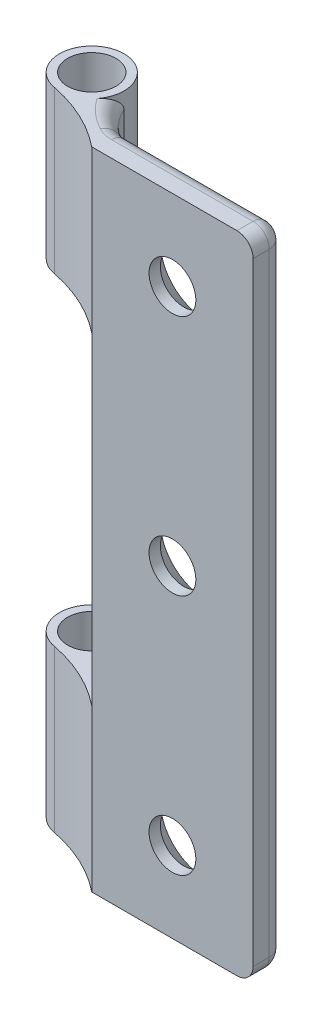
ISO-10303-21;
HEADER;
FILE_DESCRIPTION(('STEP AP214'),'2;1');
FILE_NAME('part.step','',(''),(''),'','','');
FILE_SCHEMA(('AUTOMOTIVE_DESIGN { 1 0 10303 214 1 1 1 1 }'));
ENDSEC;
DATA;
#1=APPLICATION_CONTEXT('core data for automotive mechanical design processes');
#2=APPLICATION_PROTOCOL_DEFINITION('international standard','automotive_design',2000,#1);
#3=PRODUCT_CONTEXT('',#1,'mechanical');
#4=PRODUCT('Part','Part','',(#3));
#5=PRODUCT_RELATED_PRODUCT_CATEGORY('part','',(#4));
#6=PRODUCT_DEFINITION_FORMATION('','',#4);
#7=PRODUCT_DEFINITION_CONTEXT('part definition',#1,'design');
#8=PRODUCT_DEFINITION('design','',#6,#7);
#9=PRODUCT_DEFINITION_SHAPE('','',#8);
#10=(LENGTH_UNIT() NAMED_UNIT(*) SI_UNIT(.MILLI.,.METRE.));
#11=(NAMED_UNIT(*) PLANE_ANGLE_UNIT() SI_UNIT($,.RADIAN.));
#12=(NAMED_UNIT(*) SI_UNIT($,.STERADIAN.) SOLID_ANGLE_UNIT());
#13=UNCERTAINTY_MEASURE_WITH_UNIT(LENGTH_MEASURE(1.E-05),#10,'distance_accuracy_value','');
#14=(GEOMETRIC_REPRESENTATION_CONTEXT(3) GLOBAL_UNCERTAINTY_ASSIGNED_CONTEXT((#13)) GLOBAL_UNIT_ASSIGNED_CONTEXT((#10,
#11,#12)) REPRESENTATION_CONTEXT('',''));
#15=CARTESIAN_POINT('',(0.,0.,0.));
#16=DIRECTION('',(0.,0.,1.));
#17=DIRECTION('',(1.,0.,0.));
#18=AXIS2_PLACEMENT_3D('',#15,#16,#17);
#19=CARTESIAN_POINT('',(-3.35424868893541,40.,-4.64575131106459));
#20=DIRECTION('',(0.,-1.,0.));
#21=DIRECTION('',(0.,0.,-1.));
#22=AXIS2_PLACEMENT_3D('',#19,#20,#21);
#23=CYLINDRICAL_SURFACE('',#22,4.);
#24=DIRECTION('',(0.,-1.,0.));
#25=VECTOR('',#24,1.);
#26=CARTESIAN_POINT('',(-5.23986677209954,40.,-1.1180828963118));
#27=LINE('',#26,#25);
#28=CARTESIAN_POINT('',(-5.23986677209954,10.,-1.1180828963118));
#29=VERTEX_POINT('',#28);
#30=CARTESIAN_POINT('',(-5.23986677209954,1.,-1.1180828963118));
#31=VERTEX_POINT('',#30);
#32=EDGE_CURVE('E490',#29,#31,#27,.T.);
#33=ORIENTED_EDGE('',*,*,#32,.T.);
#34=CARTESIAN_POINT('',(-3.35424868893541,1.,-4.64575131106459));
#35=DIRECTION('',(0.,-1.,0.));
#36=DIRECTION('',(0.,0.,-1.));
#37=AXIS2_PLACEMENT_3D('',#34,#35,#36);
#38=CIRCLE('',#37,4.);
#39=CARTESIAN_POINT('',(-7.,1.,-3.));
#40=VERTEX_POINT('',#39);
#41=EDGE_CURVE('E487',#31,#40,#38,.T.);
#42=ORIENTED_EDGE('',*,*,#41,.T.);
#43=DIRECTION('',(0.,-1.,0.));
#44=VECTOR('',#43,1.);
#45=CARTESIAN_POINT('',(-7.,40.,-3.));
#46=LINE('',#45,#44);
#47=CARTESIAN_POINT('',(-7.,10.,-3.));
#48=VERTEX_POINT('',#47);
#49=EDGE_CURVE('E337',#48,#40,#46,.T.);
#50=ORIENTED_EDGE('',*,*,#49,.F.);
#51=CARTESIAN_POINT('',(-3.35424868893541,10.,-4.64575131106459));
#52=DIRECTION('',(0.,-1.,0.));
#53=DIRECTION('',(0.,0.,-1.));
#54=AXIS2_PLACEMENT_3D('',#51,#52,#53);
#55=CIRCLE('',#54,4.);
#56=EDGE_CURVE('E238',#48,#29,#55,.F.);
#57=ORIENTED_EDGE('',*,*,#56,.T.);
#58=EDGE_LOOP('',(#33,#42,#50,#57));
#59=FACE_BOUND('',#58,.T.);
#60=ADVANCED_FACE('F34',(#59),#23,.F.);
#61=CARTESIAN_POINT('',(-9.,40.,-3.));
#62=DIRECTION('',(0.,-1.,0.));
#63=DIRECTION('',(0.,0.,-1.));
#64=AXIS2_PLACEMENT_3D('',#61,#62,#63);
#65=CYLINDRICAL_SURFACE('',#64,2.);
#66=CARTESIAN_POINT('',(-9.,30.,-3.));
#67=DIRECTION('',(0.,1.,0.));
#68=DIRECTION('',(0.,0.,1.));
#69=AXIS2_PLACEMENT_3D('',#66,#67,#68);
#70=CIRCLE('',#69,2.);
#71=CARTESIAN_POINT('',(-7.,30.,-3.));
#72=VERTEX_POINT('',#71);
#73=CARTESIAN_POINT('',(-9.33223157316066,30.,-1.02778749071121));
#74=VERTEX_POINT('',#73);
#75=EDGE_CURVE('E204',#72,#74,#70,.T.);
#76=ORIENTED_EDGE('',*,*,#75,.T.);
#77=DIRECTION('',(0.,-1.,0.));
#78=VECTOR('',#77,1.);
#79=CARTESIAN_POINT('',(-9.33223157316066,40.,-1.02778749071121));
#80=LINE('',#79,#78);
#81=CARTESIAN_POINT('',(-9.33223157316066,40.,-1.02778749071121));
#82=VERTEX_POINT('',#81);
#83=EDGE_CURVE('E203',#82,#74,#80,.T.);
#84=ORIENTED_EDGE('',*,*,#83,.F.);
#85=CARTESIAN_POINT('',(-9.,40.,-3.));
#86=DIRECTION('',(0.,1.,0.));
#87=DIRECTION('',(0.,0.,1.));
#88=AXIS2_PLACEMENT_3D('',#85,#86,#87);
#89=CIRCLE('',#88,2.);
#90=CARTESIAN_POINT('',(-7.43430554528277,40.,-1.75557206939585));
#91=VERTEX_POINT('',#90);
#92=EDGE_CURVE('E226',#91,#82,#89,.T.);
#93=ORIENTED_EDGE('',*,*,#92,.F.);
#94=CARTESIAN_POINT('',(-7.43430554528277,40.,-1.75557206939585));
#95=CARTESIAN_POINT('',(-7.4150057668606,40.0000030900498,-1.7798469271056));
#96=CARTESIAN_POINT('',(-7.39629370004343,39.9986695147384,-1.80455712382706));
#97=CARTESIAN_POINT('',(-7.36017475547062,39.9934906334173,-1.85460902211591));
#98=CARTESIAN_POINT('',(-7.34276610637677,39.9896488078002,-1.8799498019033));
#99=CARTESIAN_POINT('',(-7.29296343271528,39.9747024314774,-1.9561249645298));
#100=CARTESIAN_POINT('',(-7.2625829808326,39.9601698237683,-2.00763108891593));
#101=CARTESIAN_POINT('',(-7.20146143480147,39.9193193959632,-2.12229162157638));
#102=CARTESIAN_POINT('',(-7.17212813587114,39.8911053209478,-2.18550155241853));
#103=CARTESIAN_POINT('',(-7.12135311287869,39.825512162979,-2.31059719990692));
#104=CARTESIAN_POINT('',(-7.09994974370381,39.788089956275,-2.37247515130802));
#105=CARTESIAN_POINT('',(-7.06390198258814,39.7051205101415,-2.49440200308605));
#106=CARTESIAN_POINT('',(-7.04938957941584,39.6594361025798,-2.55439609412861));
#107=CARTESIAN_POINT('',(-7.03230361613203,39.5858178275685,-2.64078682289565));
#108=CARTESIAN_POINT('',(-7.02739065394011,39.5604505557457,-2.66896403410609));
#109=CARTESIAN_POINT('',(-7.01896556574205,39.507941447991,-2.72382853555625));
#110=CARTESIAN_POINT('',(-7.0154527921834,39.480800439144,-2.75051650960849));
#111=CARTESIAN_POINT('',(-7.00955402441986,39.4234976173311,-2.80290748637494));
#112=CARTESIAN_POINT('',(-7.00721646148099,39.3932598378395,-2.82853334979578));
#113=CARTESIAN_POINT('',(-7.00365730452691,39.3302872959212,-2.8767262790706));
#114=CARTESIAN_POINT('',(-7.00243619214559,39.2975514624321,-2.89929202122438));
#115=CARTESIAN_POINT('',(-7.00099625179923,39.2368576344072,-2.93497453224518));
#116=CARTESIAN_POINT('',(-7.00061327793467,39.209491844955,-2.94907420263327));
#117=CARTESIAN_POINT('',(-7.00014833159175,39.152978399649,-2.97287273009642));
#118=CARTESIAN_POINT('',(-7.0000647017332,39.1238414663835,-2.9825955576289));
#119=CARTESIAN_POINT('',(-7.00000983475217,39.0786607493764,-2.99279153053478));
#120=CARTESIAN_POINT('',(-7.00000378322867,39.0631088051266,-2.99546385421141));
#121=CARTESIAN_POINT('',(-6.99999993860628,39.0317118591225,-2.99908195841621));
#122=CARTESIAN_POINT('',(-7.00000219591448,39.0158656508253,-3.00001714865302));
#123=CARTESIAN_POINT('',(-7.,39.,-3.));
#124=B_SPLINE_CURVE_WITH_KNOTS('',3,(#94,#95,#96,#97,#98,#99,#100,#101,#102,#103,#104,#105,#106,
#107,#108,#109,#110,#111,#112,#113,#114,#115,#116,#117,#118,#119,#120,#121,#122,#123),
.UNSPECIFIED.,.F.,.F.,(4,2,2,2,2,2,2,2,2,2,2,2,2,2,4),(0.,0.0929568239538435,0.185784936429213,
0.369487359128304,0.593839793985812,0.819263616038914,1.04884650396993,1.16346750141809,
1.27803542782291,1.39700137972105,1.51601862904216,1.60813820269042,1.69974694138695,
1.74699631210699,1.79453280113445),.UNSPECIFIED.);
#125=CARTESIAN_POINT('',(-7.,39.,-3.));
#126=VERTEX_POINT('',#125);
#127=EDGE_CURVE('E343',#91,#126,#124,.T.);
#128=ORIENTED_EDGE('',*,*,#127,.T.);
#129=EDGE_CURVE('E331',#126,#72,#46,.T.);
#130=ORIENTED_EDGE('',*,*,#129,.T.);
#131=EDGE_LOOP('',(#76,#84,#93,#128,#130));
#132=FACE_BOUND('',#131,.T.);
#133=ADVANCED_FACE('F314',(#132),#65,.T.);
#134=CARTESIAN_POINT('',(-11.2823746721404,40.,8.78021648020466));
#135=DIRECTION('',(0.,-1.,0.));
#136=DIRECTION('',(0.,0.,-1.));
#137=AXIS2_PLACEMENT_3D('',#134,#135,#136);
#138=CYLINDRICAL_SURFACE('',#137,10.);
#139=DIRECTION('',(0.,-1.,0.));
#140=VECTOR('',#139,1.);
#141=CARTESIAN_POINT('',(-5.,40.,1.));
#142=LINE('',#141,#140);
#143=CARTESIAN_POINT('',(-5.,10.,1.));
#144=VERTEX_POINT('',#143);
#145=CARTESIAN_POINT('',(-5.,0.,1.));
#146=VERTEX_POINT('',#145);
#147=EDGE_CURVE('E184',#144,#146,#142,.T.);
#148=ORIENTED_EDGE('',*,*,#147,.F.);
#149=CARTESIAN_POINT('',(-11.2823746721404,10.,8.78021648020466));
#150=DIRECTION('',(0.,-1.,0.));
#151=DIRECTION('',(0.,0.,-1.));
#152=AXIS2_PLACEMENT_3D('',#149,#150,#151);
#153=CIRCLE('',#152,10.);
#154=CARTESIAN_POINT('',(-9.33223157316066,10.,-1.02778749071121));
#155=VERTEX_POINT('',#154);
#156=EDGE_CURVE('E246',#144,#155,#153,.F.);
#157=ORIENTED_EDGE('',*,*,#156,.T.);
#158=CARTESIAN_POINT('',(-9.33223157316066,0.,-1.02778749071121));
#159=VERTEX_POINT('',#158);
#160=EDGE_CURVE('E211',#155,#159,#80,.T.);
#161=ORIENTED_EDGE('',*,*,#160,.T.);
#162=CARTESIAN_POINT('',(-11.2823746721404,0.,8.78021648020466));
#163=DIRECTION('',(0.,-1.,0.));
#164=DIRECTION('',(0.,0.,-1.));
#165=AXIS2_PLACEMENT_3D('',#162,#163,#164);
#166=CIRCLE('',#165,10.);
#167=EDGE_CURVE('E227',#159,#146,#166,.T.);
#168=ORIENTED_EDGE('',*,*,#167,.T.);
#169=EDGE_LOOP('',(#148,#157,#161,#168));
#170=FACE_BOUND('',#169,.T.);
#171=ADVANCED_FACE('F320',(#170),#138,.F.);
#172=CARTESIAN_POINT('',(-9.,40.,-3.));
#173=DIRECTION('',(0.,-1.,0.));
#174=DIRECTION('',(0.,0.,-1.));
#175=AXIS2_PLACEMENT_3D('',#172,#173,#174);
#176=CYLINDRICAL_SURFACE('',#175,1.5);
#177=CARTESIAN_POINT('',(-9.,10.,-3.));
#178=DIRECTION('',(0.,-1.,0.));
#179=DIRECTION('',(0.,0.,-1.));
#180=AXIS2_PLACEMENT_3D('',#177,#178,#179);
#181=CIRCLE('',#180,1.5);
#182=CARTESIAN_POINT('',(-9.,10.,-4.5));
#183=VERTEX_POINT('',#182);
#184=EDGE_CURVE('E249',#183,#183,#181,.T.);
#185=ORIENTED_EDGE('',*,*,#184,.F.);
#186=EDGE_LOOP('',(#185));
#187=FACE_BOUND('',#186,.T.);
#188=CARTESIAN_POINT('',(-9.,0.,-3.));
#189=DIRECTION('',(0.,1.,0.));
#190=DIRECTION('',(0.,0.,1.));
#191=AXIS2_PLACEMENT_3D('',#188,#189,#190);
#192=CIRCLE('',#191,1.5);
#193=CARTESIAN_POINT('',(-9.,0.,-1.5));
#194=VERTEX_POINT('',#193);
#195=EDGE_CURVE('E235',#194,#194,#192,.T.);
#196=ORIENTED_EDGE('',*,*,#195,.F.);
#197=EDGE_LOOP('',(#196));
#198=FACE_BOUND('',#197,.T.);
#199=ADVANCED_FACE('F570',(#187,#198),#176,.F.);
#200=CARTESIAN_POINT('',(-11.2823746721404,40.,8.78021648020466));
#201=DIRECTION('',(0.,-1.,0.));
#202=DIRECTION('',(0.,0.,-1.));
#203=AXIS2_PLACEMENT_3D('',#200,#201,#202);
#204=PLANE('',#203);
#205=CARTESIAN_POINT('',(-3.35424868893541,40.,-4.64575131106459));
#206=DIRECTION('',(0.,-1.,0.));
#207=DIRECTION('',(0.,0.,-1.));
#208=AXIS2_PLACEMENT_3D('',#205,#206,#207);
#209=CIRCLE('',#208,5.);
#210=CARTESIAN_POINT('',(-5.71127129289057,40.,-0.236165792623606));
#211=VERTEX_POINT('',#210);
#212=EDGE_CURVE('E351',#211,#91,#209,.T.);
#213=ORIENTED_EDGE('',*,*,#212,.T.);
#214=ORIENTED_EDGE('',*,*,#92,.T.);
#215=CARTESIAN_POINT('',(-11.2823746721404,40.,8.78021648020466));
#216=DIRECTION('',(0.,-1.,0.));
#217=DIRECTION('',(0.,0.,-1.));
#218=AXIS2_PLACEMENT_3D('',#215,#216,#217);
#219=CIRCLE('',#218,10.);
#220=CARTESIAN_POINT('',(-5.,40.,1.));
#221=VERTEX_POINT('',#220);
#222=EDGE_CURVE('E221',#82,#221,#219,.T.);
#223=ORIENTED_EDGE('',*,*,#222,.T.);
#224=DIRECTION('',(1.,0.,0.));
#225=VECTOR('',#224,1.);
#226=CARTESIAN_POINT('',(-5.,40.,1.));
#227=LINE('',#226,#225);
#228=CARTESIAN_POINT('',(4.,40.,1.));
#229=VERTEX_POINT('',#228);
#230=EDGE_CURVE('E210',#221,#229,#227,.T.);
#231=ORIENTED_EDGE('',*,*,#230,.T.);
#232=DIRECTION('',(0.,0.,-1.));
#233=VECTOR('',#232,1.);
#234=CARTESIAN_POINT('',(4.,40.,8.78021648020466));
#235=LINE('',#234,#233);
#236=CARTESIAN_POINT('',(4.,40.,0.));
#237=VERTEX_POINT('',#236);
#238=EDGE_CURVE('E472',#229,#237,#235,.T.);
#239=ORIENTED_EDGE('',*,*,#238,.T.);
#240=DIRECTION('',(-1.,0.,0.));
#241=VECTOR('',#240,1.);
#242=CARTESIAN_POINT('',(-11.2823746721404,40.,0.));
#243=LINE('',#242,#241);
#244=CARTESIAN_POINT('',(-4.7684622513085,40.,0.));
#245=VERTEX_POINT('',#244);
#246=EDGE_CURVE('E473',#237,#245,#243,.T.);
#247=ORIENTED_EDGE('',*,*,#246,.T.);
#248=CARTESIAN_POINT('',(-4.7684622513085,40.,-2.));
#249=DIRECTION('',(0.,-1.,0.));
#250=DIRECTION('',(0.,0.,-1.));
#251=AXIS2_PLACEMENT_3D('',#248,#249,#250);
#252=CIRCLE('',#251,2.);
#253=EDGE_CURVE('E471',#211,#245,#252,.F.);
#254=ORIENTED_EDGE('',*,*,#253,.F.);
#255=EDGE_LOOP('',(#213,#214,#223,#231,#239,#247,#254));
#256=FACE_BOUND('',#255,.T.);
#257=CARTESIAN_POINT('',(-9.,40.,-3.));
#258=DIRECTION('',(0.,1.,0.));
#259=DIRECTION('',(0.,0.,1.));
#260=AXIS2_PLACEMENT_3D('',#257,#258,#259);
#261=CIRCLE('',#260,1.5);
#262=CARTESIAN_POINT('',(-9.,40.,-1.5));
#263=VERTEX_POINT('',#262);
#264=EDGE_CURVE('E231',#263,#263,#261,.T.);
#265=ORIENTED_EDGE('',*,*,#264,.F.);
#266=EDGE_LOOP('',(#265));
#267=FACE_BOUND('',#266,.T.);
#268=ADVANCED_FACE('F468',(#256,#267),#204,.F.);
#269=CARTESIAN_POINT('',(-11.2823746721404,0.,8.78021648020466));
#270=DIRECTION('',(0.,-1.,0.));
#271=DIRECTION('',(0.,0.,-1.));
#272=AXIS2_PLACEMENT_3D('',#269,#270,#271);
#273=PLANE('',#272);
#274=CARTESIAN_POINT('',(-9.,0.,-3.));
#275=DIRECTION('',(0.,1.,0.));
#276=DIRECTION('',(0.,0.,1.));
#277=AXIS2_PLACEMENT_3D('',#274,#275,#276);
#278=CIRCLE('',#277,2.);
#279=CARTESIAN_POINT('',(-7.43430554528277,0.,-1.75557206939585));
#280=VERTEX_POINT('',#279);
#281=EDGE_CURVE('E229',#280,#159,#278,.T.);
#282=ORIENTED_EDGE('',*,*,#281,.F.);
#283=CARTESIAN_POINT('',(-3.35424868893541,0.,-4.64575131106459));
#284=DIRECTION('',(0.,-1.,0.));
#285=DIRECTION('',(0.,0.,-1.));
#286=AXIS2_PLACEMENT_3D('',#283,#284,#285);
#287=CIRCLE('',#286,5.);
#288=CARTESIAN_POINT('',(-5.71127129289057,0.,-0.236165792623606));
#289=VERTEX_POINT('',#288);
#290=EDGE_CURVE('E478',#280,#289,#287,.F.);
#291=ORIENTED_EDGE('',*,*,#290,.T.);
#292=CARTESIAN_POINT('',(-4.7684622513085,0.,-2.));
#293=DIRECTION('',(0.,-1.,0.));
#294=DIRECTION('',(0.,0.,-1.));
#295=AXIS2_PLACEMENT_3D('',#292,#293,#294);
#296=CIRCLE('',#295,2.);
#297=CARTESIAN_POINT('',(-4.7684622513085,0.,0.));
#298=VERTEX_POINT('',#297);
#299=EDGE_CURVE('E480',#298,#289,#296,.T.);
#300=ORIENTED_EDGE('',*,*,#299,.F.);
#301=DIRECTION('',(-1.,0.,0.));
#302=VECTOR('',#301,1.);
#303=CARTESIAN_POINT('',(4.,0.,0.));
#304=LINE('',#303,#302);
#305=CARTESIAN_POINT('',(4.,0.,0.));
#306=VERTEX_POINT('',#305);
#307=EDGE_CURVE('E485',#298,#306,#304,.F.);
#308=ORIENTED_EDGE('',*,*,#307,.T.);
#309=DIRECTION('',(0.,0.,-1.));
#310=VECTOR('',#309,1.);
#311=CARTESIAN_POINT('',(4.,0.,1.));
#312=LINE('',#311,#310);
#313=CARTESIAN_POINT('',(4.,0.,1.));
#314=VERTEX_POINT('',#313);
#315=EDGE_CURVE('E483',#306,#314,#312,.F.);
#316=ORIENTED_EDGE('',*,*,#315,.T.);
#317=DIRECTION('',(1.,0.,0.));
#318=VECTOR('',#317,1.);
#319=CARTESIAN_POINT('',(-5.,0.,1.));
#320=LINE('',#319,#318);
#321=EDGE_CURVE('E224',#146,#314,#320,.T.);
#322=ORIENTED_EDGE('',*,*,#321,.F.);
#323=ORIENTED_EDGE('',*,*,#167,.F.);
#324=EDGE_LOOP('',(#282,#291,#300,#308,#316,#322,#323));
#325=FACE_BOUND('',#324,.T.);
#326=ORIENTED_EDGE('',*,*,#195,.T.);
#327=EDGE_LOOP('',(#326));
#328=FACE_BOUND('',#327,.T.);
#329=ADVANCED_FACE('F521',(#325,#328),#273,.T.);
#330=CARTESIAN_POINT('',(5.,40.,-1.));
#331=DIRECTION('',(-1.,0.,0.));
#332=DIRECTION('',(0.,0.,1.));
#333=AXIS2_PLACEMENT_3D('',#330,#331,#332);
#334=PLANE('',#333);
#335=DIRECTION('',(0.,-1.,0.));
#336=VECTOR('',#335,1.);
#337=CARTESIAN_POINT('',(5.,40.,1.));
#338=LINE('',#337,#336);
#339=CARTESIAN_POINT('',(5.,39.,1.));
#340=VERTEX_POINT('',#339);
#341=CARTESIAN_POINT('',(5.,1.,1.));
#342=VERTEX_POINT('',#341);
#343=EDGE_CURVE('E214',#340,#342,#338,.T.);
#344=ORIENTED_EDGE('',*,*,#343,.T.);
#345=DIRECTION('',(0.,0.,-1.));
#346=VECTOR('',#345,1.);
#347=CARTESIAN_POINT('',(5.,1.,0.));
#348=LINE('',#347,#346);
#349=CARTESIAN_POINT('',(5.,1.,0.));
#350=VERTEX_POINT('',#349);
#351=EDGE_CURVE('E349',#342,#350,#348,.T.);
#352=ORIENTED_EDGE('',*,*,#351,.T.);
#353=DIRECTION('',(0.,-1.,0.));
#354=VECTOR('',#353,1.);
#355=CARTESIAN_POINT('',(5.,40.,0.));
#356=LINE('',#355,#354);
#357=CARTESIAN_POINT('',(5.,39.,0.));
#358=VERTEX_POINT('',#357);
#359=EDGE_CURVE('E496',#350,#358,#356,.F.);
#360=ORIENTED_EDGE('',*,*,#359,.T.);
#361=DIRECTION('',(0.,0.,-1.));
#362=VECTOR('',#361,1.);
#363=CARTESIAN_POINT('',(5.,39.,-1.));
#364=LINE('',#363,#362);
#365=EDGE_CURVE('E346',#358,#340,#364,.F.);
#366=ORIENTED_EDGE('',*,*,#365,.T.);
#367=EDGE_LOOP('',(#344,#352,#360,#366));
#368=FACE_BOUND('',#367,.T.);
#369=ADVANCED_FACE('F290',(#368),#334,.F.);
#370=CARTESIAN_POINT('',(-5.,40.,-1.));
#371=DIRECTION('',(0.,0.,1.));
#372=DIRECTION('',(1.,0.,0.));
#373=AXIS2_PLACEMENT_3D('',#370,#371,#372);
#374=PLANE('',#373);
#375=CARTESIAN_POINT('',(0.,35.,-1.));
#376=DIRECTION('',(0.,0.,-1.));
#377=DIRECTION('',(-1.,0.,0.));
#378=AXIS2_PLACEMENT_3D('',#375,#376,#377);
#379=CIRCLE('',#378,2.75);
#380=CARTESIAN_POINT('',(-2.75,35.,-1.));
#381=VERTEX_POINT('',#380);
#382=EDGE_CURVE('E280',#381,#381,#379,.T.);
#383=ORIENTED_EDGE('',*,*,#382,.F.);
#384=EDGE_LOOP('',(#383));
#385=FACE_BOUND('',#384,.T.);
#386=CARTESIAN_POINT('',(0.,20.,-1.));
#387=DIRECTION('',(0.,0.,-1.));
#388=DIRECTION('',(-1.,0.,0.));
#389=AXIS2_PLACEMENT_3D('',#386,#387,#388);
#390=CIRCLE('',#389,2.75);
#391=CARTESIAN_POINT('',(-2.75,20.,-1.));
#392=VERTEX_POINT('',#391);
#393=EDGE_CURVE('E271',#392,#392,#390,.T.);
#394=ORIENTED_EDGE('',*,*,#393,.F.);
#395=EDGE_LOOP('',(#394));
#396=FACE_BOUND('',#395,.T.);
#397=CARTESIAN_POINT('',(0.,5.,-1.));
#398=DIRECTION('',(0.,0.,-1.));
#399=DIRECTION('',(-1.,0.,0.));
#400=AXIS2_PLACEMENT_3D('',#397,#398,#399);
#401=CIRCLE('',#400,2.75);
#402=CARTESIAN_POINT('',(-2.75,5.,-1.));
#403=VERTEX_POINT('',#402);
#404=EDGE_CURVE('E262',#403,#403,#401,.T.);
#405=ORIENTED_EDGE('',*,*,#404,.F.);
#406=EDGE_LOOP('',(#405));
#407=FACE_BOUND('',#406,.T.);
#408=DIRECTION('',(-1.,0.,0.));
#409=VECTOR('',#408,1.);
#410=CARTESIAN_POINT('',(-5.,1.,-1.));
#411=LINE('',#410,#409);
#412=CARTESIAN_POINT('',(4.,1.,-1.));
#413=VERTEX_POINT('',#412);
#414=CARTESIAN_POINT('',(-4.7684622513085,1.,-1.));
#415=VERTEX_POINT('',#414);
#416=EDGE_CURVE('E51',#413,#415,#411,.T.);
#417=ORIENTED_EDGE('',*,*,#416,.T.);
#418=DIRECTION('',(0.,1.,0.));
#419=VECTOR('',#418,1.);
#420=CARTESIAN_POINT('',(-4.7684622513085,10.,-1.));
#421=LINE('',#420,#419);
#422=CARTESIAN_POINT('',(-4.7684622513085,10.,-1.));
#423=VERTEX_POINT('',#422);
#424=EDGE_CURVE('E368',#415,#423,#421,.T.);
#425=ORIENTED_EDGE('',*,*,#424,.T.);
#426=DIRECTION('',(1.,0.,0.));
#427=VECTOR('',#426,1.);
#428=CARTESIAN_POINT('',(-5.,10.,-1.));
#429=LINE('',#428,#427);
#430=CARTESIAN_POINT('',(-4.,10.,-1.));
#431=VERTEX_POINT('',#430);
#432=EDGE_CURVE('E506',#423,#431,#429,.T.);
#433=ORIENTED_EDGE('',*,*,#432,.T.);
#434=DIRECTION('',(0.,1.,0.));
#435=VECTOR('',#434,1.);
#436=CARTESIAN_POINT('',(-4.,40.,-1.));
#437=LINE('',#436,#435);
#438=CARTESIAN_POINT('',(-4.,30.,-1.));
#439=VERTEX_POINT('',#438);
#440=EDGE_CURVE('E503',#431,#439,#437,.T.);
#441=ORIENTED_EDGE('',*,*,#440,.T.);
#442=DIRECTION('',(-1.,0.,0.));
#443=VECTOR('',#442,1.);
#444=CARTESIAN_POINT('',(-5.,30.,-1.));
#445=LINE('',#444,#443);
#446=CARTESIAN_POINT('',(-4.7684622513085,30.,-1.));
#447=VERTEX_POINT('',#446);
#448=EDGE_CURVE('E501',#439,#447,#445,.T.);
#449=ORIENTED_EDGE('',*,*,#448,.T.);
#450=DIRECTION('',(0.,1.,0.));
#451=VECTOR('',#450,1.);
#452=CARTESIAN_POINT('',(-4.7684622513085,40.,-1.));
#453=LINE('',#452,#451);
#454=CARTESIAN_POINT('',(-4.7684622513085,39.,-1.));
#455=VERTEX_POINT('',#454);
#456=EDGE_CURVE('E58',#447,#455,#453,.T.);
#457=ORIENTED_EDGE('',*,*,#456,.T.);
#458=DIRECTION('',(-1.,0.,0.));
#459=VECTOR('',#458,1.);
#460=CARTESIAN_POINT('',(-5.,39.,-1.));
#461=LINE('',#460,#459);
#462=CARTESIAN_POINT('',(4.,39.,-1.));
#463=VERTEX_POINT('',#462);
#464=EDGE_CURVE('E364',#455,#463,#461,.F.);
#465=ORIENTED_EDGE('',*,*,#464,.T.);
#466=DIRECTION('',(0.,-1.,0.));
#467=VECTOR('',#466,1.);
#468=CARTESIAN_POINT('',(4.,40.,-1.));
#469=LINE('',#468,#467);
#470=EDGE_CURVE('E336',#463,#413,#469,.T.);
#471=ORIENTED_EDGE('',*,*,#470,.T.);
#472=EDGE_LOOP('',(#417,#425,#433,#441,#449,#457,#465,#471));
#473=FACE_BOUND('',#472,.T.);
#474=ADVANCED_FACE('F286',(#385,#396,#407,#473),#374,.F.);
#475=ORIENTED_EDGE('',*,*,#129,.F.);
#476=CARTESIAN_POINT('',(-3.35424868893541,39.,-4.64575131106459));
#477=DIRECTION('',(0.,-1.,0.));
#478=DIRECTION('',(0.,0.,-1.));
#479=AXIS2_PLACEMENT_3D('',#476,#477,#478);
#480=CIRCLE('',#479,4.);
#481=CARTESIAN_POINT('',(-5.23986677209954,39.,-1.1180828963118));
#482=VERTEX_POINT('',#481);
#483=EDGE_CURVE('E333',#126,#482,#480,.F.);
#484=ORIENTED_EDGE('',*,*,#483,.T.);
#485=DIRECTION('',(0.,-1.,0.));
#486=VECTOR('',#485,1.);
#487=CARTESIAN_POINT('',(-5.23986677209954,40.,-1.1180828963118));
#488=LINE('',#487,#486);
#489=CARTESIAN_POINT('',(-5.23986677209954,30.,-1.1180828963118));
#490=VERTEX_POINT('',#489);
#491=EDGE_CURVE('E347',#482,#490,#488,.T.);
#492=ORIENTED_EDGE('',*,*,#491,.T.);
#493=CARTESIAN_POINT('',(-3.35424868893541,30.,-4.64575131106459));
#494=DIRECTION('',(0.,1.,0.));
#495=DIRECTION('',(0.,0.,1.));
#496=AXIS2_PLACEMENT_3D('',#493,#494,#495);
#497=CIRCLE('',#496,4.);
#498=EDGE_CURVE('E250',#490,#72,#497,.F.);
#499=ORIENTED_EDGE('',*,*,#498,.T.);
#500=EDGE_LOOP('',(#475,#484,#492,#499));
#501=FACE_BOUND('',#500,.T.);
#502=ADVANCED_FACE('F289',(#501),#23,.F.);
#503=ORIENTED_EDGE('',*,*,#160,.F.);
#504=CARTESIAN_POINT('',(-9.,10.,-3.));
#505=DIRECTION('',(0.,-1.,0.));
#506=DIRECTION('',(0.,0.,-1.));
#507=AXIS2_PLACEMENT_3D('',#504,#505,#506);
#508=CIRCLE('',#507,2.);
#509=EDGE_CURVE('E243',#155,#48,#508,.T.);
#510=ORIENTED_EDGE('',*,*,#509,.T.);
#511=ORIENTED_EDGE('',*,*,#49,.T.);
#512=CARTESIAN_POINT('',(-7.,1.,-3.));
#513=CARTESIAN_POINT('',(-7.00001600882772,0.971394802430576,-3.00012450577553));
#514=CARTESIAN_POINT('',(-6.99999782122762,0.943014417588416,-2.99701651868959));
#515=CARTESIAN_POINT('',(-7.00003965372611,0.887818924211479,-2.98568495833966));
#516=CARTESIAN_POINT('',(-7.00009820165769,0.860984366293188,-2.97755921619747));
#517=CARTESIAN_POINT('',(-7.00050630035952,0.79684417120492,-2.95281142888668));
#518=CARTESIAN_POINT('',(-7.00097769408092,0.760422309245653,-2.93399891647664));
#519=CARTESIAN_POINT('',(-7.00283871731921,0.690347357794743,-2.89131024122151));
#520=CARTESIAN_POINT('',(-7.00423807554927,0.656727898375037,-2.86738226901986));
#521=CARTESIAN_POINT('',(-7.00826880429912,0.592270033132825,-2.81655028546425));
#522=CARTESIAN_POINT('',(-7.01089258502165,0.56141587125857,-2.78966537705677));
#523=CARTESIAN_POINT('',(-7.01760155464585,0.501880963854742,-2.7337412868909));
#524=CARTESIAN_POINT('',(-7.0216880077493,0.47320212454484,-2.7047002588407));
#525=CARTESIAN_POINT('',(-7.03643364991756,0.390181090978632,-2.61522958688397));
#526=CARTESIAN_POINT('',(-7.04958175872967,0.338802009505108,-2.5524082604158));
#527=CARTESIAN_POINT('',(-7.08512828600033,0.241026373678041,-2.4182427886198));
#528=CARTESIAN_POINT('',(-7.10811263017681,0.195235014340291,-2.34660998365989));
#529=CARTESIAN_POINT('',(-7.16479630220378,0.115847271994824,-2.20122171035336));
#530=CARTESIAN_POINT('',(-7.19842851230342,0.0821772503698071,-2.12748210172731));
#531=CARTESIAN_POINT('',(-7.26509231859684,0.038551698326744,-2.00329922003063));
#532=CARTESIAN_POINT('',(-7.29509786579063,0.024483179640799,-1.95269855410546));
#533=CARTESIAN_POINT('',(-7.34419860144866,0.0100161421906985,-1.87784705648353));
#534=CARTESIAN_POINT('',(-7.36135109512864,0.00629799470676912,-1.85294038693172));
#535=CARTESIAN_POINT('',(-7.39691389673722,0.00128661655247354,-1.80373843353294));
#536=CARTESIAN_POINT('',(-7.41532594745838,-3.18079604335879E-06,-1.77944406315932));
#537=CARTESIAN_POINT('',(-7.43430554528277,0.,-1.75557206939585));
#538=B_SPLINE_CURVE_WITH_KNOTS('',3,(#512,#513,#514,#515,#516,#517,#518,#519,#520,#521,#522,
#523,#524,#525,#526,#527,#528,#529,#530,#531,#532,#533,#534,#535,#536,#537),.UNSPECIFIED.,.F.,
.F.,(4,2,2,2,2,2,2,2,2,2,2,2,4),(0.,0.085291929139372,0.168971248544498,0.29127380428794,
0.414879282021526,0.537728544590111,0.660684244372455,0.906392167712888,1.16939354719163,
1.43076906825239,1.61137435235165,1.70266451806756,1.79408365770262),.UNSPECIFIED.);
#539=EDGE_CURVE('E370',#40,#280,#538,.T.);
#540=ORIENTED_EDGE('',*,*,#539,.T.);
#541=ORIENTED_EDGE('',*,*,#281,.T.);
#542=EDGE_LOOP('',(#503,#510,#511,#540,#541));
#543=FACE_BOUND('',#542,.T.);
#544=ADVANCED_FACE('F323',(#543),#65,.T.);
#545=ORIENTED_EDGE('',*,*,#83,.T.);
#546=CARTESIAN_POINT('',(-11.2823746721404,30.,8.78021648020466));
#547=DIRECTION('',(0.,1.,0.));
#548=DIRECTION('',(0.,0.,1.));
#549=AXIS2_PLACEMENT_3D('',#546,#547,#548);
#550=CIRCLE('',#549,10.);
#551=CARTESIAN_POINT('',(-5.,30.,1.));
#552=VERTEX_POINT('',#551);
#553=EDGE_CURVE('E191',#74,#552,#550,.F.);
#554=ORIENTED_EDGE('',*,*,#553,.T.);
#555=EDGE_CURVE('E183',#221,#552,#142,.T.);
#556=ORIENTED_EDGE('',*,*,#555,.F.);
#557=ORIENTED_EDGE('',*,*,#222,.F.);
#558=EDGE_LOOP('',(#545,#554,#556,#557));
#559=FACE_BOUND('',#558,.T.);
#560=ADVANCED_FACE('F199',(#559),#138,.F.);
#561=CARTESIAN_POINT('',(-5.,40.,1.));
#562=DIRECTION('',(0.,0.,-1.));
#563=DIRECTION('',(-1.,0.,0.));
#564=AXIS2_PLACEMENT_3D('',#561,#562,#563);
#565=PLANE('',#564);
#566=CARTESIAN_POINT('',(0.,35.,1.));
#567=DIRECTION('',(0.,0.,-1.));
#568=DIRECTION('',(-1.,0.,0.));
#569=AXIS2_PLACEMENT_3D('',#566,#567,#568);
#570=CIRCLE('',#569,1.45);
#571=CARTESIAN_POINT('',(-1.45,35.,1.));
#572=VERTEX_POINT('',#571);
#573=EDGE_CURVE('E274',#572,#572,#570,.T.);
#574=ORIENTED_EDGE('',*,*,#573,.T.);
#575=EDGE_LOOP('',(#574));
#576=FACE_BOUND('',#575,.T.);
#577=CARTESIAN_POINT('',(0.,20.,1.));
#578=DIRECTION('',(0.,0.,-1.));
#579=DIRECTION('',(-1.,0.,0.));
#580=AXIS2_PLACEMENT_3D('',#577,#578,#579);
#581=CIRCLE('',#580,1.45);
#582=CARTESIAN_POINT('',(-1.45,20.,1.));
#583=VERTEX_POINT('',#582);
#584=EDGE_CURVE('E265',#583,#583,#581,.T.);
#585=ORIENTED_EDGE('',*,*,#584,.T.);
#586=EDGE_LOOP('',(#585));
#587=FACE_BOUND('',#586,.T.);
#588=CARTESIAN_POINT('',(0.,5.,1.));
#589=DIRECTION('',(0.,0.,-1.));
#590=DIRECTION('',(-1.,0.,0.));
#591=AXIS2_PLACEMENT_3D('',#588,#589,#590);
#592=CIRCLE('',#591,1.45);
#593=CARTESIAN_POINT('',(-1.45,5.,1.));
#594=VERTEX_POINT('',#593);
#595=EDGE_CURVE('E255',#594,#594,#592,.T.);
#596=ORIENTED_EDGE('',*,*,#595,.T.);
#597=EDGE_LOOP('',(#596));
#598=FACE_BOUND('',#597,.T.);
#599=ORIENTED_EDGE('',*,*,#321,.T.);
#600=CARTESIAN_POINT('',(4.,1.,1.));
#601=DIRECTION('',(0.,0.,-1.));
#602=DIRECTION('',(-1.,0.,0.));
#603=AXIS2_PLACEMENT_3D('',#600,#601,#602);
#604=CIRCLE('',#603,1.);
#605=EDGE_CURVE('E358',#314,#342,#604,.F.);
#606=ORIENTED_EDGE('',*,*,#605,.T.);
#607=ORIENTED_EDGE('',*,*,#343,.F.);
#608=CARTESIAN_POINT('',(4.,39.,1.));
#609=DIRECTION('',(0.,0.,-1.));
#610=DIRECTION('',(-1.,0.,0.));
#611=AXIS2_PLACEMENT_3D('',#608,#609,#610);
#612=CIRCLE('',#611,1.);
#613=EDGE_CURVE('E356',#340,#229,#612,.F.);
#614=ORIENTED_EDGE('',*,*,#613,.T.);
#615=ORIENTED_EDGE('',*,*,#230,.F.);
#616=ORIENTED_EDGE('',*,*,#555,.T.);
#617=EDGE_CURVE('E173',#552,#144,#142,.T.);
#618=ORIENTED_EDGE('',*,*,#617,.T.);
#619=ORIENTED_EDGE('',*,*,#147,.T.);
#620=EDGE_LOOP('',(#599,#606,#607,#614,#615,#616,#618,#619));
#621=FACE_BOUND('',#620,.T.);
#622=ADVANCED_FACE('F208',(#576,#587,#598,#621),#565,.F.);
#623=CARTESIAN_POINT('',(-9.,30.,-3.));
#624=DIRECTION('',(0.,1.,0.));
#625=DIRECTION('',(0.,0.,1.));
#626=AXIS2_PLACEMENT_3D('',#623,#624,#625);
#627=CIRCLE('',#626,1.5);
#628=CARTESIAN_POINT('',(-9.,30.,-1.5));
#629=VERTEX_POINT('',#628);
#630=EDGE_CURVE('E205',#629,#629,#627,.T.);
#631=ORIENTED_EDGE('',*,*,#630,.F.);
#632=EDGE_LOOP('',(#631));
#633=FACE_BOUND('',#632,.T.);
#634=ORIENTED_EDGE('',*,*,#264,.T.);
#635=EDGE_LOOP('',(#634));
#636=FACE_BOUND('',#635,.T.);
#637=ADVANCED_FACE('F565',(#633,#636),#176,.F.);
#638=CARTESIAN_POINT('',(-5.,0.,40.));
#639=DIRECTION('',(1.,0.,0.));
#640=DIRECTION('',(0.,0.,-1.));
#641=AXIS2_PLACEMENT_3D('',#638,#639,#640);
#642=PLANE('',#641);
#643=DIRECTION('',(0.,0.,-1.));
#644=VECTOR('',#643,1.);
#645=CARTESIAN_POINT('',(-5.,30.,40.));
#646=LINE('',#645,#644);
#647=CARTESIAN_POINT('',(-5.,30.,0.));
#648=VERTEX_POINT('',#647);
#649=EDGE_CURVE('E176',#552,#648,#646,.T.);
#650=ORIENTED_EDGE('',*,*,#649,.T.);
#651=DIRECTION('',(0.,1.,0.));
#652=VECTOR('',#651,1.);
#653=CARTESIAN_POINT('',(-5.,0.,0.));
#654=LINE('',#653,#652);
#655=CARTESIAN_POINT('',(-5.,10.,0.));
#656=VERTEX_POINT('',#655);
#657=EDGE_CURVE('E499',#648,#656,#654,.F.);
#658=ORIENTED_EDGE('',*,*,#657,.T.);
#659=DIRECTION('',(0.,0.,-1.));
#660=VECTOR('',#659,1.);
#661=CARTESIAN_POINT('',(-5.,10.,40.));
#662=LINE('',#661,#660);
#663=EDGE_CURVE('E179',#144,#656,#662,.T.);
#664=ORIENTED_EDGE('',*,*,#663,.F.);
#665=ORIENTED_EDGE('',*,*,#617,.F.);
#666=EDGE_LOOP('',(#650,#658,#664,#665));
#667=FACE_BOUND('',#666,.T.);
#668=ADVANCED_FACE('F175',(#667),#642,.F.);
#669=CARTESIAN_POINT('',(0.,10.,40.));
#670=DIRECTION('',(0.,-1.,0.));
#671=DIRECTION('',(0.,0.,-1.));
#672=AXIS2_PLACEMENT_3D('',#669,#670,#671);
#673=PLANE('',#672);
#674=ORIENTED_EDGE('',*,*,#184,.T.);
#675=EDGE_LOOP('',(#674));
#676=FACE_BOUND('',#675,.T.);
#677=ORIENTED_EDGE('',*,*,#509,.F.);
#678=ORIENTED_EDGE('',*,*,#156,.F.);
#679=ORIENTED_EDGE('',*,*,#663,.T.);
#680=CARTESIAN_POINT('',(-4.,10.,0.));
#681=DIRECTION('',(0.,-1.,0.));
#682=DIRECTION('',(0.,0.,-1.));
#683=AXIS2_PLACEMENT_3D('',#680,#681,#682);
#684=CIRCLE('',#683,1.);
#685=EDGE_CURVE('E492',#656,#431,#684,.T.);
#686=ORIENTED_EDGE('',*,*,#685,.T.);
#687=ORIENTED_EDGE('',*,*,#432,.F.);
#688=CARTESIAN_POINT('',(-4.7684622513085,10.,-2.));
#689=DIRECTION('',(0.,-1.,0.));
#690=DIRECTION('',(0.,0.,-1.));
#691=AXIS2_PLACEMENT_3D('',#688,#689,#690);
#692=CIRCLE('',#691,1.);
#693=EDGE_CURVE('E43',#423,#29,#692,.T.);
#694=ORIENTED_EDGE('',*,*,#693,.T.);
#695=ORIENTED_EDGE('',*,*,#56,.F.);
#696=EDGE_LOOP('',(#677,#678,#679,#686,#687,#694,#695));
#697=FACE_BOUND('',#696,.T.);
#698=ADVANCED_FACE('F542',(#676,#697),#673,.F.);
#699=CARTESIAN_POINT('',(0.,30.,40.));
#700=DIRECTION('',(0.,1.,0.));
#701=DIRECTION('',(0.,0.,1.));
#702=AXIS2_PLACEMENT_3D('',#699,#700,#701);
#703=PLANE('',#702);
#704=ORIENTED_EDGE('',*,*,#630,.T.);
#705=EDGE_LOOP('',(#704));
#706=FACE_BOUND('',#705,.T.);
#707=ORIENTED_EDGE('',*,*,#649,.F.);
#708=ORIENTED_EDGE('',*,*,#553,.F.);
#709=ORIENTED_EDGE('',*,*,#75,.F.);
#710=ORIENTED_EDGE('',*,*,#498,.F.);
#711=CARTESIAN_POINT('',(-4.7684622513085,30.,-2.));
#712=DIRECTION('',(0.,1.,0.));
#713=DIRECTION('',(0.,0.,1.));
#714=AXIS2_PLACEMENT_3D('',#711,#712,#713);
#715=CIRCLE('',#714,1.);
#716=EDGE_CURVE('E11',#490,#447,#715,.T.);
#717=ORIENTED_EDGE('',*,*,#716,.T.);
#718=ORIENTED_EDGE('',*,*,#448,.F.);
#719=CARTESIAN_POINT('',(-4.,30.,0.));
#720=DIRECTION('',(0.,1.,0.));
#721=DIRECTION('',(0.,0.,1.));
#722=AXIS2_PLACEMENT_3D('',#719,#720,#721);
#723=CIRCLE('',#722,1.);
#724=EDGE_CURVE('E194',#439,#648,#723,.T.);
#725=ORIENTED_EDGE('',*,*,#724,.T.);
#726=EDGE_LOOP('',(#707,#708,#709,#710,#717,#718,#725));
#727=FACE_BOUND('',#726,.T.);
#728=ADVANCED_FACE('F189',(#706,#727),#703,.F.);
#729=CARTESIAN_POINT('',(-4.,40.,0.));
#730=DIRECTION('',(0.,1.,0.));
#731=DIRECTION('',(0.,0.,1.));
#732=AXIS2_PLACEMENT_3D('',#729,#730,#731);
#733=CYLINDRICAL_SURFACE('',#732,1.);
#734=ORIENTED_EDGE('',*,*,#685,.F.);
#735=ORIENTED_EDGE('',*,*,#657,.F.);
#736=ORIENTED_EDGE('',*,*,#724,.F.);
#737=ORIENTED_EDGE('',*,*,#440,.F.);
#738=EDGE_LOOP('',(#734,#735,#736,#737));
#739=FACE_BOUND('',#738,.T.);
#740=ADVANCED_FACE('F541',(#739),#733,.T.);
#741=CARTESIAN_POINT('',(4.,40.,0.));
#742=DIRECTION('',(0.,-1.,0.));
#743=DIRECTION('',(0.,0.,-1.));
#744=AXIS2_PLACEMENT_3D('',#741,#742,#743);
#745=CYLINDRICAL_SURFACE('',#744,1.);
#746=ORIENTED_EDGE('',*,*,#359,.F.);
#747=CARTESIAN_POINT('',(4.,1.,0.));
#748=DIRECTION('',(0.,-1.,0.));
#749=DIRECTION('',(0.,0.,-1.));
#750=AXIS2_PLACEMENT_3D('',#747,#748,#749);
#751=CIRCLE('',#750,1.);
#752=EDGE_CURVE('E362',#350,#413,#751,.F.);
#753=ORIENTED_EDGE('',*,*,#752,.T.);
#754=ORIENTED_EDGE('',*,*,#470,.F.);
#755=CARTESIAN_POINT('',(4.,39.,0.));
#756=DIRECTION('',(0.,-1.,0.));
#757=DIRECTION('',(0.,0.,-1.));
#758=AXIS2_PLACEMENT_3D('',#755,#756,#757);
#759=CIRCLE('',#758,1.);
#760=EDGE_CURVE('E360',#463,#358,#759,.T.);
#761=ORIENTED_EDGE('',*,*,#760,.T.);
#762=EDGE_LOOP('',(#746,#753,#754,#761));
#763=FACE_BOUND('',#762,.T.);
#764=ADVANCED_FACE('F393',(#763),#745,.T.);
#765=CARTESIAN_POINT('',(4.,1.,-1.));
#766=DIRECTION('',(0.,0.,1.));
#767=DIRECTION('',(1.,0.,0.));
#768=AXIS2_PLACEMENT_3D('',#765,#766,#767);
#769=CYLINDRICAL_SURFACE('',#768,1.);
#770=CARTESIAN_POINT('',(4.,1.,0.));
#771=DIRECTION('',(0.,0.,-1.));
#772=DIRECTION('',(-1.,0.,0.));
#773=AXIS2_PLACEMENT_3D('',#770,#771,#772);
#774=CIRCLE('',#773,1.);
#775=EDGE_CURVE('E195',#350,#306,#774,.T.);
#776=ORIENTED_EDGE('',*,*,#775,.F.);
#777=ORIENTED_EDGE('',*,*,#351,.F.);
#778=ORIENTED_EDGE('',*,*,#605,.F.);
#779=ORIENTED_EDGE('',*,*,#315,.F.);
#780=EDGE_LOOP('',(#776,#777,#778,#779));
#781=FACE_BOUND('',#780,.T.);
#782=ADVANCED_FACE('F409',(#781),#769,.T.);
#783=CARTESIAN_POINT('',(4.,1.,0.));
#784=DIRECTION('',(0.,-1.,0.));
#785=DIRECTION('',(0.,0.,-1.));
#786=AXIS2_PLACEMENT_3D('',#783,#784,#785);
#787=SPHERICAL_SURFACE('',#786,1.);
#788=ORIENTED_EDGE('',*,*,#752,.F.);
#789=ORIENTED_EDGE('',*,*,#775,.T.);
#790=CARTESIAN_POINT('',(4.,1.,0.));
#791=DIRECTION('',(-1.,0.,0.));
#792=DIRECTION('',(0.,0.,1.));
#793=AXIS2_PLACEMENT_3D('',#790,#791,#792);
#794=CIRCLE('',#793,1.);
#795=EDGE_CURVE('E457',#413,#306,#794,.T.);
#796=ORIENTED_EDGE('',*,*,#795,.F.);
#797=EDGE_LOOP('',(#788,#789,#796));
#798=FACE_BOUND('',#797,.T.);
#799=ADVANCED_FACE('F405',(#798),#787,.T.);
#800=CARTESIAN_POINT('',(-5.,1.,0.));
#801=DIRECTION('',(1.,0.,0.));
#802=DIRECTION('',(0.,0.,-1.));
#803=AXIS2_PLACEMENT_3D('',#800,#801,#802);
#804=CYLINDRICAL_SURFACE('',#803,1.);
#805=ORIENTED_EDGE('',*,*,#795,.T.);
#806=ORIENTED_EDGE('',*,*,#307,.F.);
#807=CARTESIAN_POINT('',(-4.7684622513085,1.,0.));
#808=DIRECTION('',(-1.,0.,0.));
#809=DIRECTION('',(0.,0.,1.));
#810=AXIS2_PLACEMENT_3D('',#807,#808,#809);
#811=CIRCLE('',#810,1.);
#812=EDGE_CURVE('E460',#415,#298,#811,.T.);
#813=ORIENTED_EDGE('',*,*,#812,.F.);
#814=ORIENTED_EDGE('',*,*,#416,.F.);
#815=EDGE_LOOP('',(#805,#806,#813,#814));
#816=FACE_BOUND('',#815,.T.);
#817=ADVANCED_FACE('F401',(#816),#804,.T.);
#818=CARTESIAN_POINT('',(-4.7684622513085,40.,-2.));
#819=DIRECTION('',(0.,-1.,0.));
#820=DIRECTION('',(0.,0.,-1.));
#821=AXIS2_PLACEMENT_3D('',#818,#819,#820);
#822=CYLINDRICAL_SURFACE('',#821,1.);
#823=ORIENTED_EDGE('',*,*,#693,.F.);
#824=ORIENTED_EDGE('',*,*,#424,.F.);
#825=CARTESIAN_POINT('',(-4.7684622513085,1.,-2.));
#826=DIRECTION('',(0.,-1.,0.));
#827=DIRECTION('',(0.,0.,-1.));
#828=AXIS2_PLACEMENT_3D('',#825,#826,#827);
#829=CIRCLE('',#828,1.);
#830=EDGE_CURVE('E445',#31,#415,#829,.F.);
#831=ORIENTED_EDGE('',*,*,#830,.F.);
#832=ORIENTED_EDGE('',*,*,#32,.F.);
#833=EDGE_LOOP('',(#823,#824,#831,#832));
#834=FACE_BOUND('',#833,.T.);
#835=ADVANCED_FACE('F397',(#834),#822,.F.);
#836=CARTESIAN_POINT('',(-4.7684622513085,1.,-2.));
#837=DIRECTION('',(0.,-1.,0.));
#838=DIRECTION('',(0.,0.,-1.));
#839=AXIS2_PLACEMENT_3D('',#836,#837,#838);
#840=TOROIDAL_SURFACE('',#839,2.,1.);
#841=ORIENTED_EDGE('',*,*,#812,.T.);
#842=ORIENTED_EDGE('',*,*,#299,.T.);
#843=CARTESIAN_POINT('',(-5.71127129289057,1.,-0.236165792623606));
#844=DIRECTION('',(0.881917103688197,0.,0.471404520791032));
#845=DIRECTION('',(0.471404520791032,0.,-0.881917103688197));
#846=AXIS2_PLACEMENT_3D('',#843,#844,#845);
#847=CIRCLE('',#846,1.);
#848=EDGE_CURVE('E443',#31,#289,#847,.F.);
#849=ORIENTED_EDGE('',*,*,#848,.F.);
#850=ORIENTED_EDGE('',*,*,#830,.T.);
#851=EDGE_LOOP('',(#841,#842,#849,#850));
#852=FACE_BOUND('',#851,.T.);
#853=ADVANCED_FACE('F391',(#852),#840,.T.);
#854=CARTESIAN_POINT('',(-3.35424868893541,1.,-4.64575131106459));
#855=DIRECTION('',(0.,-1.,0.));
#856=DIRECTION('',(0.,0.,-1.));
#857=AXIS2_PLACEMENT_3D('',#854,#855,#856);
#858=TOROIDAL_SURFACE('',#857,5.,1.);
#859=ORIENTED_EDGE('',*,*,#848,.T.);
#860=ORIENTED_EDGE('',*,*,#290,.F.);
#861=ORIENTED_EDGE('',*,*,#539,.F.);
#862=ORIENTED_EDGE('',*,*,#41,.F.);
#863=EDGE_LOOP('',(#859,#860,#861,#862));
#864=FACE_BOUND('',#863,.T.);
#865=ADVANCED_FACE('F386',(#864),#858,.T.);
#866=CARTESIAN_POINT('',(4.,39.,8.78021648020466));
#867=DIRECTION('',(0.,0.,-1.));
#868=DIRECTION('',(-1.,0.,0.));
#869=AXIS2_PLACEMENT_3D('',#866,#867,#868);
#870=CYLINDRICAL_SURFACE('',#869,1.);
#871=ORIENTED_EDGE('',*,*,#613,.F.);
#872=ORIENTED_EDGE('',*,*,#365,.F.);
#873=CARTESIAN_POINT('',(4.,39.,0.));
#874=DIRECTION('',(0.,0.,-1.));
#875=DIRECTION('',(-1.,0.,0.));
#876=AXIS2_PLACEMENT_3D('',#873,#874,#875);
#877=CIRCLE('',#876,1.);
#878=EDGE_CURVE('E38',#237,#358,#877,.T.);
#879=ORIENTED_EDGE('',*,*,#878,.F.);
#880=ORIENTED_EDGE('',*,*,#238,.F.);
#881=EDGE_LOOP('',(#871,#872,#879,#880));
#882=FACE_BOUND('',#881,.T.);
#883=ADVANCED_FACE('F36',(#882),#870,.T.);
#884=CARTESIAN_POINT('',(4.,39.,0.));
#885=DIRECTION('',(0.,-1.,0.));
#886=DIRECTION('',(0.,0.,-1.));
#887=AXIS2_PLACEMENT_3D('',#884,#885,#886);
#888=SPHERICAL_SURFACE('',#887,1.);
#889=ORIENTED_EDGE('',*,*,#878,.T.);
#890=ORIENTED_EDGE('',*,*,#760,.F.);
#891=CARTESIAN_POINT('',(4.,39.,0.));
#892=DIRECTION('',(-1.,0.,0.));
#893=DIRECTION('',(0.,0.,1.));
#894=AXIS2_PLACEMENT_3D('',#891,#892,#893);
#895=CIRCLE('',#894,1.);
#896=EDGE_CURVE('E439',#237,#463,#895,.T.);
#897=ORIENTED_EDGE('',*,*,#896,.F.);
#898=EDGE_LOOP('',(#889,#890,#897));
#899=FACE_BOUND('',#898,.T.);
#900=ADVANCED_FACE('F426',(#899),#888,.T.);
#901=CARTESIAN_POINT('',(-4.7684622513085,40.,-2.));
#902=DIRECTION('',(0.,-1.,0.));
#903=DIRECTION('',(0.,0.,-1.));
#904=AXIS2_PLACEMENT_3D('',#901,#902,#903);
#905=CYLINDRICAL_SURFACE('',#904,1.);
#906=ORIENTED_EDGE('',*,*,#716,.F.);
#907=ORIENTED_EDGE('',*,*,#491,.F.);
#908=CARTESIAN_POINT('',(-4.7684622513085,39.,-2.));
#909=DIRECTION('',(0.,-1.,0.));
#910=DIRECTION('',(0.,0.,-1.));
#911=AXIS2_PLACEMENT_3D('',#908,#909,#910);
#912=CIRCLE('',#911,1.);
#913=EDGE_CURVE('E447',#455,#482,#912,.T.);
#914=ORIENTED_EDGE('',*,*,#913,.F.);
#915=ORIENTED_EDGE('',*,*,#456,.F.);
#916=EDGE_LOOP('',(#906,#907,#914,#915));
#917=FACE_BOUND('',#916,.T.);
#918=ADVANCED_FACE('F423',(#917),#905,.F.);
#919=CARTESIAN_POINT('',(-11.2823746721404,39.,0.));
#920=DIRECTION('',(-1.,0.,0.));
#921=DIRECTION('',(0.,0.,1.));
#922=AXIS2_PLACEMENT_3D('',#919,#920,#921);
#923=CYLINDRICAL_SURFACE('',#922,1.);
#924=ORIENTED_EDGE('',*,*,#896,.T.);
#925=ORIENTED_EDGE('',*,*,#464,.F.);
#926=CARTESIAN_POINT('',(-4.7684622513085,39.,0.));
#927=DIRECTION('',(-1.,0.,0.));
#928=DIRECTION('',(0.,0.,1.));
#929=AXIS2_PLACEMENT_3D('',#926,#927,#928);
#930=CIRCLE('',#929,1.);
#931=EDGE_CURVE('E449',#245,#455,#930,.T.);
#932=ORIENTED_EDGE('',*,*,#931,.F.);
#933=ORIENTED_EDGE('',*,*,#246,.F.);
#934=EDGE_LOOP('',(#924,#925,#932,#933));
#935=FACE_BOUND('',#934,.T.);
#936=ADVANCED_FACE('F419',(#935),#923,.T.);
#937=CARTESIAN_POINT('',(-4.7684622513085,39.,-2.));
#938=DIRECTION('',(0.,-1.,0.));
#939=DIRECTION('',(0.,0.,-1.));
#940=AXIS2_PLACEMENT_3D('',#937,#938,#939);
#941=TOROIDAL_SURFACE('',#940,2.,1.);
#942=ORIENTED_EDGE('',*,*,#931,.T.);
#943=ORIENTED_EDGE('',*,*,#913,.T.);
#944=CARTESIAN_POINT('',(-5.71127129289057,39.,-0.236165792623606));
#945=DIRECTION('',(0.881917103688197,0.,0.471404520791032));
#946=DIRECTION('',(0.471404520791032,0.,-0.881917103688197));
#947=AXIS2_PLACEMENT_3D('',#944,#945,#946);
#948=CIRCLE('',#947,1.);
#949=EDGE_CURVE('E258',#211,#482,#948,.F.);
#950=ORIENTED_EDGE('',*,*,#949,.F.);
#951=ORIENTED_EDGE('',*,*,#253,.T.);
#952=EDGE_LOOP('',(#942,#943,#950,#951));
#953=FACE_BOUND('',#952,.T.);
#954=ADVANCED_FACE('F416',(#953),#941,.T.);
#955=CARTESIAN_POINT('',(-3.35424868893541,39.,-4.64575131106459));
#956=DIRECTION('',(0.,-1.,0.));
#957=DIRECTION('',(0.,0.,-1.));
#958=AXIS2_PLACEMENT_3D('',#955,#956,#957);
#959=TOROIDAL_SURFACE('',#958,5.,1.);
#960=ORIENTED_EDGE('',*,*,#949,.T.);
#961=ORIENTED_EDGE('',*,*,#483,.F.);
#962=ORIENTED_EDGE('',*,*,#127,.F.);
#963=ORIENTED_EDGE('',*,*,#212,.F.);
#964=EDGE_LOOP('',(#960,#961,#962,#963));
#965=FACE_BOUND('',#964,.T.);
#966=ADVANCED_FACE('F309',(#965),#959,.T.);
#967=CARTESIAN_POINT('',(0.,5.,-1.));
#968=DIRECTION('',(0.,0.,-1.));
#969=DIRECTION('',(-1.,0.,0.));
#970=AXIS2_PLACEMENT_3D('',#967,#968,#969);
#971=CYLINDRICAL_SURFACE('',#970,1.45);
#972=ORIENTED_EDGE('',*,*,#595,.F.);
#973=EDGE_LOOP('',(#972));
#974=FACE_BOUND('',#973,.T.);
#975=CARTESIAN_POINT('',(0.,5.,0.300000000000001));
#976=DIRECTION('',(0.,0.,-1.));
#977=DIRECTION('',(-1.,0.,0.));
#978=AXIS2_PLACEMENT_3D('',#975,#976,#977);
#979=CIRCLE('',#978,1.45);
#980=CARTESIAN_POINT('',(-1.45,5.,0.300000000000001));
#981=VERTEX_POINT('',#980);
#982=EDGE_CURVE('E259',#981,#981,#979,.T.);
#983=ORIENTED_EDGE('',*,*,#982,.T.);
#984=EDGE_LOOP('',(#983));
#985=FACE_BOUND('',#984,.T.);
#986=ADVANCED_FACE('F299',(#974,#985),#971,.F.);
#987=CARTESIAN_POINT('',(0.,5.,-1.));
#988=DIRECTION('',(0.,0.,-1.));
#989=DIRECTION('',(-1.,0.,0.));
#990=AXIS2_PLACEMENT_3D('',#987,#988,#989);
#991=CONICAL_SURFACE('',#990,2.75,0.785398163397448);
#992=ORIENTED_EDGE('',*,*,#982,.F.);
#993=EDGE_LOOP('',(#992));
#994=FACE_BOUND('',#993,.T.);
#995=ORIENTED_EDGE('',*,*,#404,.T.);
#996=EDGE_LOOP('',(#995));
#997=FACE_BOUND('',#996,.T.);
#998=ADVANCED_FACE('F296',(#994,#997),#991,.F.);
#999=CARTESIAN_POINT('',(0.,20.,-1.));
#1000=DIRECTION('',(0.,0.,-1.));
#1001=DIRECTION('',(-1.,0.,0.));
#1002=AXIS2_PLACEMENT_3D('',#999,#1000,#1001);
#1003=CYLINDRICAL_SURFACE('',#1002,1.45);
#1004=ORIENTED_EDGE('',*,*,#584,.F.);
#1005=EDGE_LOOP('',(#1004));
#1006=FACE_BOUND('',#1005,.T.);
#1007=CARTESIAN_POINT('',(0.,20.,0.300000000000001));
#1008=DIRECTION('',(0.,0.,-1.));
#1009=DIRECTION('',(-1.,0.,0.));
#1010=AXIS2_PLACEMENT_3D('',#1007,#1008,#1009);
#1011=CIRCLE('',#1010,1.45);
#1012=CARTESIAN_POINT('',(-1.45,20.,0.300000000000001));
#1013=VERTEX_POINT('',#1012);
#1014=EDGE_CURVE('E268',#1013,#1013,#1011,.T.);
#1015=ORIENTED_EDGE('',*,*,#1014,.T.);
#1016=EDGE_LOOP('',(#1015));
#1017=FACE_BOUND('',#1016,.T.);
#1018=ADVANCED_FACE('F298',(#1006,#1017),#1003,.F.);
#1019=CARTESIAN_POINT('',(0.,20.,-1.));
#1020=DIRECTION('',(0.,0.,-1.));
#1021=DIRECTION('',(-1.,0.,0.));
#1022=AXIS2_PLACEMENT_3D('',#1019,#1020,#1021);
#1023=CONICAL_SURFACE('',#1022,2.75,0.785398163397448);
#1024=ORIENTED_EDGE('',*,*,#1014,.F.);
#1025=EDGE_LOOP('',(#1024));
#1026=FACE_BOUND('',#1025,.T.);
#1027=ORIENTED_EDGE('',*,*,#393,.T.);
#1028=EDGE_LOOP('',(#1027));
#1029=FACE_BOUND('',#1028,.T.);
#1030=ADVANCED_FACE('F306',(#1026,#1029),#1023,.F.);
#1031=CARTESIAN_POINT('',(0.,35.,-1.));
#1032=DIRECTION('',(0.,0.,-1.));
#1033=DIRECTION('',(-1.,0.,0.));
#1034=AXIS2_PLACEMENT_3D('',#1031,#1032,#1033);
#1035=CYLINDRICAL_SURFACE('',#1034,1.45);
#1036=ORIENTED_EDGE('',*,*,#573,.F.);
#1037=EDGE_LOOP('',(#1036));
#1038=FACE_BOUND('',#1037,.T.);
#1039=CARTESIAN_POINT('',(0.,35.,0.300000000000001));
#1040=DIRECTION('',(0.,0.,-1.));
#1041=DIRECTION('',(-1.,0.,0.));
#1042=AXIS2_PLACEMENT_3D('',#1039,#1040,#1041);
#1043=CIRCLE('',#1042,1.45);
#1044=CARTESIAN_POINT('',(-1.45,35.,0.300000000000001));
#1045=VERTEX_POINT('',#1044);
#1046=EDGE_CURVE('E277',#1045,#1045,#1043,.T.);
#1047=ORIENTED_EDGE('',*,*,#1046,.T.);
#1048=EDGE_LOOP('',(#1047));
#1049=FACE_BOUND('',#1048,.T.);
#1050=ADVANCED_FACE('F740',(#1038,#1049),#1035,.F.);
#1051=CARTESIAN_POINT('',(0.,35.,-1.));
#1052=DIRECTION('',(0.,0.,-1.));
#1053=DIRECTION('',(-1.,0.,0.));
#1054=AXIS2_PLACEMENT_3D('',#1051,#1052,#1053);
#1055=CONICAL_SURFACE('',#1054,2.75,0.785398163397448);
#1056=ORIENTED_EDGE('',*,*,#1046,.F.);
#1057=EDGE_LOOP('',(#1056));
#1058=FACE_BOUND('',#1057,.T.);
#1059=ORIENTED_EDGE('',*,*,#382,.T.);
#1060=EDGE_LOOP('',(#1059));
#1061=FACE_BOUND('',#1060,.T.);
#1062=ADVANCED_FACE('F284',(#1058,#1061),#1055,.F.);
#1063=CLOSED_SHELL('',(#60,#133,#171,#199,#268,#329,#369,#474,#502,#544,#560,#622,#637,#668,
#698,#728,#740,#764,#782,#799,#817,#835,#853,#865,#883,#900,#918,#936,#954,#966,#986,#998,#1018,
#1030,#1050,#1062));
#1064=MANIFOLD_SOLID_BREP('B2',#1063);
#1065=ADVANCED_BREP_SHAPE_REPRESENTATION('',(#18,#1064),#14);
#1066=SHAPE_DEFINITION_REPRESENTATION(#9,#1065);
ENDSEC;
END-ISO-10303-21;
